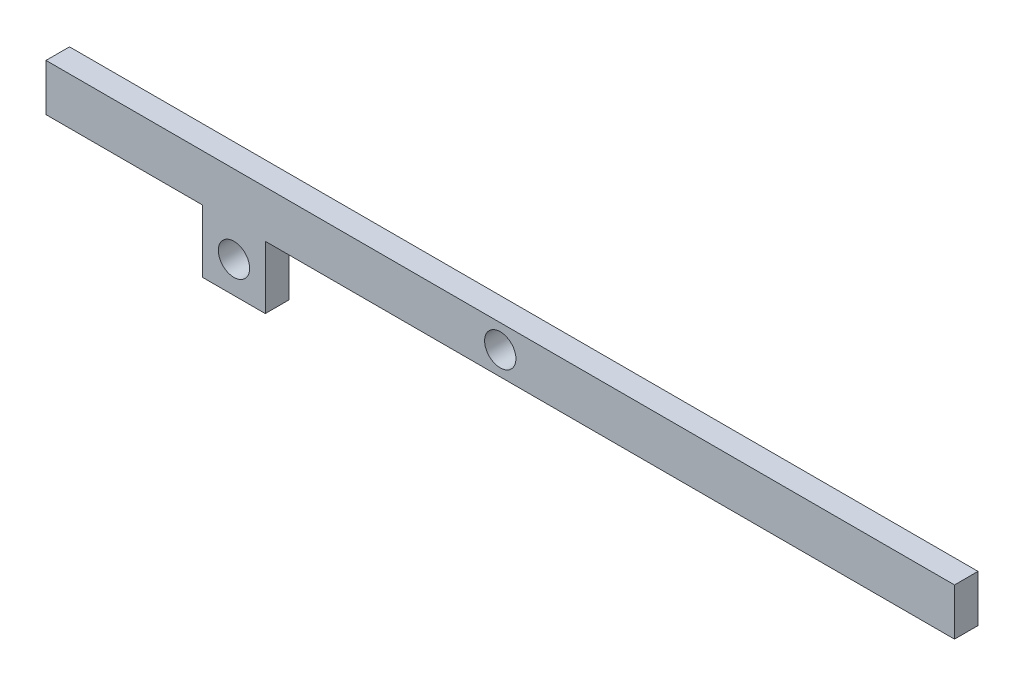
ISO-10303-21;
HEADER;
FILE_DESCRIPTION(('STEP AP214'),'2;1');
FILE_NAME('part.step','',(''),(''),'','','');
FILE_SCHEMA(('AUTOMOTIVE_DESIGN { 1 0 10303 214 1 1 1 1 }'));
ENDSEC;
DATA;
#1=APPLICATION_CONTEXT('core data for automotive mechanical design processes');
#2=APPLICATION_PROTOCOL_DEFINITION('international standard','automotive_design',2000,#1);
#3=PRODUCT_CONTEXT('',#1,'mechanical');
#4=PRODUCT('Part','Part','',(#3));
#5=PRODUCT_RELATED_PRODUCT_CATEGORY('part','',(#4));
#6=PRODUCT_DEFINITION_FORMATION('','',#4);
#7=PRODUCT_DEFINITION_CONTEXT('part definition',#1,'design');
#8=PRODUCT_DEFINITION('design','',#6,#7);
#9=PRODUCT_DEFINITION_SHAPE('','',#8);
#10=(LENGTH_UNIT() NAMED_UNIT(*) SI_UNIT(.MILLI.,.METRE.));
#11=(NAMED_UNIT(*) PLANE_ANGLE_UNIT() SI_UNIT($,.RADIAN.));
#12=(NAMED_UNIT(*) SI_UNIT($,.STERADIAN.) SOLID_ANGLE_UNIT());
#13=UNCERTAINTY_MEASURE_WITH_UNIT(LENGTH_MEASURE(1.E-05),#10,'distance_accuracy_value','');
#14=(GEOMETRIC_REPRESENTATION_CONTEXT(3) GLOBAL_UNCERTAINTY_ASSIGNED_CONTEXT((#13)) GLOBAL_UNIT_ASSIGNED_CONTEXT((#10,
#11,#12)) REPRESENTATION_CONTEXT('',''));
#15=CARTESIAN_POINT('',(0.,0.,0.));
#16=DIRECTION('',(0.,0.,1.));
#17=DIRECTION('',(1.,0.,0.));
#18=AXIS2_PLACEMENT_3D('',#15,#16,#17);
#19=CARTESIAN_POINT('',(290.,-15.,7.5));
#20=DIRECTION('',(0.,1.,0.));
#21=DIRECTION('',(-1.,0.,0.));
#22=AXIS2_PLACEMENT_3D('',#19,#20,#21);
#23=PLANE('',#22);
#24=DIRECTION('',(0.,0.,1.));
#25=VECTOR('',#24,1.);
#26=CARTESIAN_POINT('',(-150.,-15.,-7.5));
#27=LINE('',#26,#25);
#28=CARTESIAN_POINT('',(-150.,-15.,-7.5));
#29=VERTEX_POINT('',#28);
#30=CARTESIAN_POINT('',(-150.,-15.,7.5));
#31=VERTEX_POINT('',#30);
#32=EDGE_CURVE('E152',#29,#31,#27,.T.);
#33=ORIENTED_EDGE('',*,*,#32,.F.);
#34=DIRECTION('',(1.,0.,0.));
#35=VECTOR('',#34,1.);
#36=CARTESIAN_POINT('',(290.,-15.,-7.5));
#37=LINE('',#36,#35);
#38=CARTESIAN_POINT('',(290.,-15.,-7.5));
#39=VERTEX_POINT('',#38);
#40=EDGE_CURVE('E168',#29,#39,#37,.T.);
#41=ORIENTED_EDGE('',*,*,#40,.T.);
#42=DIRECTION('',(0.,0.,-1.));
#43=VECTOR('',#42,1.);
#44=CARTESIAN_POINT('',(290.,-15.,7.5));
#45=LINE('',#44,#43);
#46=CARTESIAN_POINT('',(290.,-15.,7.5));
#47=VERTEX_POINT('',#46);
#48=EDGE_CURVE('E50',#47,#39,#45,.T.);
#49=ORIENTED_EDGE('',*,*,#48,.F.);
#50=DIRECTION('',(1.,0.,0.));
#51=VECTOR('',#50,1.);
#52=CARTESIAN_POINT('',(290.,-15.,7.5));
#53=LINE('',#52,#51);
#54=EDGE_CURVE('E159',#31,#47,#53,.T.);
#55=ORIENTED_EDGE('',*,*,#54,.F.);
#56=EDGE_LOOP('',(#33,#41,#49,#55));
#57=FACE_BOUND('',#56,.T.);
#58=ADVANCED_FACE('F41',(#57),#23,.F.);
#59=CARTESIAN_POINT('',(-290.,15.,7.5));
#60=DIRECTION('',(1.,0.,0.));
#61=DIRECTION('',(0.,0.,-1.));
#62=AXIS2_PLACEMENT_3D('',#59,#60,#61);
#63=PLANE('',#62);
#64=DIRECTION('',(0.,-1.,0.));
#65=VECTOR('',#64,1.);
#66=CARTESIAN_POINT('',(-290.,15.,-7.5));
#67=LINE('',#66,#65);
#68=CARTESIAN_POINT('',(-290.,15.,-7.5));
#69=VERTEX_POINT('',#68);
#70=CARTESIAN_POINT('',(-290.,-15.,-7.5));
#71=VERTEX_POINT('',#70);
#72=EDGE_CURVE('E165',#69,#71,#67,.T.);
#73=ORIENTED_EDGE('',*,*,#72,.T.);
#74=DIRECTION('',(0.,0.,-1.));
#75=VECTOR('',#74,1.);
#76=CARTESIAN_POINT('',(-290.,-15.,7.5));
#77=LINE('',#76,#75);
#78=CARTESIAN_POINT('',(-290.,-15.,7.5));
#79=VERTEX_POINT('',#78);
#80=EDGE_CURVE('E11',#79,#71,#77,.T.);
#81=ORIENTED_EDGE('',*,*,#80,.F.);
#82=DIRECTION('',(0.,-1.,0.));
#83=VECTOR('',#82,1.);
#84=CARTESIAN_POINT('',(-290.,15.,7.5));
#85=LINE('',#84,#83);
#86=CARTESIAN_POINT('',(-290.,15.,7.5));
#87=VERTEX_POINT('',#86);
#88=EDGE_CURVE('E157',#87,#79,#85,.T.);
#89=ORIENTED_EDGE('',*,*,#88,.F.);
#90=DIRECTION('',(0.,0.,-1.));
#91=VECTOR('',#90,1.);
#92=CARTESIAN_POINT('',(-290.,15.,7.5));
#93=LINE('',#92,#91);
#94=EDGE_CURVE('E164',#87,#69,#93,.T.);
#95=ORIENTED_EDGE('',*,*,#94,.T.);
#96=EDGE_LOOP('',(#73,#81,#89,#95));
#97=FACE_BOUND('',#96,.T.);
#98=ADVANCED_FACE('F43',(#97),#63,.F.);
#99=CARTESIAN_POINT('',(-190.,-15.,-7.5));
#100=VERTEX_POINT('',#99);
#101=EDGE_CURVE('E169',#71,#100,#37,.T.);
#102=ORIENTED_EDGE('',*,*,#101,.T.);
#103=DIRECTION('',(0.,0.,1.));
#104=VECTOR('',#103,1.);
#105=CARTESIAN_POINT('',(-190.,-15.,-7.5));
#106=LINE('',#105,#104);
#107=CARTESIAN_POINT('',(-190.,-15.,7.5));
#108=VERTEX_POINT('',#107);
#109=EDGE_CURVE('E137',#100,#108,#106,.T.);
#110=ORIENTED_EDGE('',*,*,#109,.T.);
#111=EDGE_CURVE('E93',#79,#108,#53,.T.);
#112=ORIENTED_EDGE('',*,*,#111,.F.);
#113=ORIENTED_EDGE('',*,*,#80,.T.);
#114=EDGE_LOOP('',(#102,#110,#112,#113));
#115=FACE_BOUND('',#114,.T.);
#116=ADVANCED_FACE('F199',(#115),#23,.F.);
#117=CARTESIAN_POINT('',(290.,15.,7.5));
#118=DIRECTION('',(-1.,0.,0.));
#119=DIRECTION('',(0.,0.,1.));
#120=AXIS2_PLACEMENT_3D('',#117,#118,#119);
#121=PLANE('',#120);
#122=DIRECTION('',(0.,1.,0.));
#123=VECTOR('',#122,1.);
#124=CARTESIAN_POINT('',(290.,15.,-7.5));
#125=LINE('',#124,#123);
#126=CARTESIAN_POINT('',(290.,15.,-7.5));
#127=VERTEX_POINT('',#126);
#128=EDGE_CURVE('E171',#39,#127,#125,.T.);
#129=ORIENTED_EDGE('',*,*,#128,.T.);
#130=DIRECTION('',(0.,0.,-1.));
#131=VECTOR('',#130,1.);
#132=CARTESIAN_POINT('',(290.,15.,7.5));
#133=LINE('',#132,#131);
#134=CARTESIAN_POINT('',(290.,15.,7.5));
#135=VERTEX_POINT('',#134);
#136=EDGE_CURVE('E175',#135,#127,#133,.T.);
#137=ORIENTED_EDGE('',*,*,#136,.F.);
#138=DIRECTION('',(0.,1.,0.));
#139=VECTOR('',#138,1.);
#140=CARTESIAN_POINT('',(290.,15.,7.5));
#141=LINE('',#140,#139);
#142=EDGE_CURVE('E161',#47,#135,#141,.T.);
#143=ORIENTED_EDGE('',*,*,#142,.F.);
#144=ORIENTED_EDGE('',*,*,#48,.T.);
#145=EDGE_LOOP('',(#129,#137,#143,#144));
#146=FACE_BOUND('',#145,.T.);
#147=ADVANCED_FACE('F182',(#146),#121,.F.);
#148=CARTESIAN_POINT('',(290.,15.,7.5));
#149=DIRECTION('',(0.,-1.,0.));
#150=DIRECTION('',(1.,0.,0.));
#151=AXIS2_PLACEMENT_3D('',#148,#149,#150);
#152=PLANE('',#151);
#153=DIRECTION('',(-1.,0.,0.));
#154=VECTOR('',#153,1.);
#155=CARTESIAN_POINT('',(290.,15.,-7.5));
#156=LINE('',#155,#154);
#157=EDGE_CURVE('E87',#127,#69,#156,.T.);
#158=ORIENTED_EDGE('',*,*,#157,.T.);
#159=ORIENTED_EDGE('',*,*,#94,.F.);
#160=DIRECTION('',(-1.,0.,0.));
#161=VECTOR('',#160,1.);
#162=CARTESIAN_POINT('',(290.,15.,7.5));
#163=LINE('',#162,#161);
#164=EDGE_CURVE('E66',#135,#87,#163,.T.);
#165=ORIENTED_EDGE('',*,*,#164,.F.);
#166=ORIENTED_EDGE('',*,*,#136,.T.);
#167=EDGE_LOOP('',(#158,#159,#165,#166));
#168=FACE_BOUND('',#167,.T.);
#169=ADVANCED_FACE('F189',(#168),#152,.F.);
#170=CARTESIAN_POINT('',(0.,0.,7.5));
#171=DIRECTION('',(0.,0.,-1.));
#172=DIRECTION('',(-1.,0.,0.));
#173=AXIS2_PLACEMENT_3D('',#170,#171,#172);
#174=PLANE('',#173);
#175=CARTESIAN_POINT('',(0.,0.,7.5));
#176=DIRECTION('',(0.,0.,1.));
#177=DIRECTION('',(1.,0.,0.));
#178=AXIS2_PLACEMENT_3D('',#175,#176,#177);
#179=CIRCLE('',#178,10.);
#180=CARTESIAN_POINT('',(10.,0.,7.5));
#181=VERTEX_POINT('',#180);
#182=EDGE_CURVE('E151',#181,#181,#179,.T.);
#183=ORIENTED_EDGE('',*,*,#182,.F.);
#184=EDGE_LOOP('',(#183));
#185=FACE_BOUND('',#184,.T.);
#186=ORIENTED_EDGE('',*,*,#88,.T.);
#187=ORIENTED_EDGE('',*,*,#111,.T.);
#188=DIRECTION('',(0.,-1.,0.));
#189=VECTOR('',#188,1.);
#190=CARTESIAN_POINT('',(-190.,-15.,7.5));
#191=LINE('',#190,#189);
#192=CARTESIAN_POINT('',(-190.,-55.,7.5));
#193=VERTEX_POINT('',#192);
#194=EDGE_CURVE('E57',#108,#193,#191,.T.);
#195=ORIENTED_EDGE('',*,*,#194,.T.);
#196=DIRECTION('',(1.,0.,0.));
#197=VECTOR('',#196,1.);
#198=CARTESIAN_POINT('',(-190.,-55.,7.5));
#199=LINE('',#198,#197);
#200=CARTESIAN_POINT('',(-150.,-55.,7.5));
#201=VERTEX_POINT('',#200);
#202=EDGE_CURVE('E121',#193,#201,#199,.T.);
#203=ORIENTED_EDGE('',*,*,#202,.T.);
#204=DIRECTION('',(0.,1.,0.));
#205=VECTOR('',#204,1.);
#206=CARTESIAN_POINT('',(-150.,-15.,7.5));
#207=LINE('',#206,#205);
#208=EDGE_CURVE('E138',#201,#31,#207,.T.);
#209=ORIENTED_EDGE('',*,*,#208,.T.);
#210=ORIENTED_EDGE('',*,*,#54,.T.);
#211=ORIENTED_EDGE('',*,*,#142,.T.);
#212=ORIENTED_EDGE('',*,*,#164,.T.);
#213=EDGE_LOOP('',(#186,#187,#195,#203,#209,#210,#211,#212));
#214=FACE_BOUND('',#213,.T.);
#215=CARTESIAN_POINT('',(-170.,-35.,7.5));
#216=DIRECTION('',(0.,0.,1.));
#217=DIRECTION('',(1.,0.,0.));
#218=AXIS2_PLACEMENT_3D('',#215,#216,#217);
#219=CIRCLE('',#218,10.);
#220=CARTESIAN_POINT('',(-160.,-35.,7.5));
#221=VERTEX_POINT('',#220);
#222=EDGE_CURVE('E143',#221,#221,#219,.T.);
#223=ORIENTED_EDGE('',*,*,#222,.F.);
#224=EDGE_LOOP('',(#223));
#225=FACE_BOUND('',#224,.T.);
#226=ADVANCED_FACE('F191',(#185,#214,#225),#174,.F.);
#227=CARTESIAN_POINT('',(0.,0.,-7.5));
#228=DIRECTION('',(0.,0.,-1.));
#229=DIRECTION('',(-1.,0.,0.));
#230=AXIS2_PLACEMENT_3D('',#227,#228,#229);
#231=PLANE('',#230);
#232=CARTESIAN_POINT('',(0.,0.,-7.5));
#233=DIRECTION('',(0.,0.,-1.));
#234=DIRECTION('',(-1.,0.,0.));
#235=AXIS2_PLACEMENT_3D('',#232,#233,#234);
#236=CIRCLE('',#235,10.);
#237=CARTESIAN_POINT('',(-10.,0.,-7.5));
#238=VERTEX_POINT('',#237);
#239=EDGE_CURVE('E45',#238,#238,#236,.T.);
#240=ORIENTED_EDGE('',*,*,#239,.F.);
#241=EDGE_LOOP('',(#240));
#242=FACE_BOUND('',#241,.T.);
#243=ORIENTED_EDGE('',*,*,#72,.F.);
#244=ORIENTED_EDGE('',*,*,#157,.F.);
#245=ORIENTED_EDGE('',*,*,#128,.F.);
#246=ORIENTED_EDGE('',*,*,#40,.F.);
#247=DIRECTION('',(0.,1.,0.));
#248=VECTOR('',#247,1.);
#249=CARTESIAN_POINT('',(-150.,-15.,-7.5));
#250=LINE('',#249,#248);
#251=CARTESIAN_POINT('',(-150.,-55.,-7.5));
#252=VERTEX_POINT('',#251);
#253=EDGE_CURVE('E124',#252,#29,#250,.T.);
#254=ORIENTED_EDGE('',*,*,#253,.F.);
#255=DIRECTION('',(1.,0.,0.));
#256=VECTOR('',#255,1.);
#257=CARTESIAN_POINT('',(-190.,-55.,-7.5));
#258=LINE('',#257,#256);
#259=CARTESIAN_POINT('',(-190.,-55.,-7.5));
#260=VERTEX_POINT('',#259);
#261=EDGE_CURVE('E119',#260,#252,#258,.T.);
#262=ORIENTED_EDGE('',*,*,#261,.F.);
#263=DIRECTION('',(0.,-1.,0.));
#264=VECTOR('',#263,1.);
#265=CARTESIAN_POINT('',(-190.,-15.,-7.5));
#266=LINE('',#265,#264);
#267=EDGE_CURVE('E132',#100,#260,#266,.T.);
#268=ORIENTED_EDGE('',*,*,#267,.F.);
#269=ORIENTED_EDGE('',*,*,#101,.F.);
#270=EDGE_LOOP('',(#243,#244,#245,#246,#254,#262,#268,#269));
#271=FACE_BOUND('',#270,.T.);
#272=CARTESIAN_POINT('',(-170.,-35.,-7.5));
#273=DIRECTION('',(0.,0.,1.));
#274=DIRECTION('',(1.,0.,0.));
#275=AXIS2_PLACEMENT_3D('',#272,#273,#274);
#276=CIRCLE('',#275,10.);
#277=CARTESIAN_POINT('',(-160.,-35.,-7.5));
#278=VERTEX_POINT('',#277);
#279=EDGE_CURVE('E148',#278,#278,#276,.T.);
#280=ORIENTED_EDGE('',*,*,#279,.T.);
#281=EDGE_LOOP('',(#280));
#282=FACE_BOUND('',#281,.T.);
#283=ADVANCED_FACE('F130',(#242,#271,#282),#231,.T.);
#284=CARTESIAN_POINT('',(0.,0.,-12.5));
#285=DIRECTION('',(0.,0.,1.));
#286=DIRECTION('',(1.,0.,0.));
#287=AXIS2_PLACEMENT_3D('',#284,#285,#286);
#288=CYLINDRICAL_SURFACE('',#287,10.);
#289=ORIENTED_EDGE('',*,*,#239,.T.);
#290=EDGE_LOOP('',(#289));
#291=FACE_BOUND('',#290,.T.);
#292=ORIENTED_EDGE('',*,*,#182,.T.);
#293=EDGE_LOOP('',(#292));
#294=FACE_BOUND('',#293,.T.);
#295=ADVANCED_FACE('F222',(#291,#294),#288,.F.);
#296=CARTESIAN_POINT('',(-190.,-15.,-7.5));
#297=DIRECTION('',(-1.,0.,0.));
#298=DIRECTION('',(0.,-1.,0.));
#299=AXIS2_PLACEMENT_3D('',#296,#297,#298);
#300=PLANE('',#299);
#301=ORIENTED_EDGE('',*,*,#194,.F.);
#302=ORIENTED_EDGE('',*,*,#109,.F.);
#303=ORIENTED_EDGE('',*,*,#267,.T.);
#304=DIRECTION('',(0.,0.,1.));
#305=VECTOR('',#304,1.);
#306=CARTESIAN_POINT('',(-190.,-55.,-7.5));
#307=LINE('',#306,#305);
#308=EDGE_CURVE('E116',#260,#193,#307,.T.);
#309=ORIENTED_EDGE('',*,*,#308,.T.);
#310=EDGE_LOOP('',(#301,#302,#303,#309));
#311=FACE_BOUND('',#310,.T.);
#312=ADVANCED_FACE('F136',(#311),#300,.T.);
#313=CARTESIAN_POINT('',(-150.,-15.,-7.5));
#314=DIRECTION('',(1.,0.,0.));
#315=DIRECTION('',(0.,0.,-1.));
#316=AXIS2_PLACEMENT_3D('',#313,#314,#315);
#317=PLANE('',#316);
#318=ORIENTED_EDGE('',*,*,#208,.F.);
#319=DIRECTION('',(0.,0.,1.));
#320=VECTOR('',#319,1.);
#321=CARTESIAN_POINT('',(-150.,-55.,-7.5));
#322=LINE('',#321,#320);
#323=EDGE_CURVE('E123',#252,#201,#322,.T.);
#324=ORIENTED_EDGE('',*,*,#323,.F.);
#325=ORIENTED_EDGE('',*,*,#253,.T.);
#326=ORIENTED_EDGE('',*,*,#32,.T.);
#327=EDGE_LOOP('',(#318,#324,#325,#326));
#328=FACE_BOUND('',#327,.T.);
#329=ADVANCED_FACE('F213',(#328),#317,.T.);
#330=CARTESIAN_POINT('',(-190.,-55.,-7.5));
#331=DIRECTION('',(0.,-1.,0.));
#332=DIRECTION('',(0.,0.,-1.));
#333=AXIS2_PLACEMENT_3D('',#330,#331,#332);
#334=PLANE('',#333);
#335=ORIENTED_EDGE('',*,*,#202,.F.);
#336=ORIENTED_EDGE('',*,*,#308,.F.);
#337=ORIENTED_EDGE('',*,*,#261,.T.);
#338=ORIENTED_EDGE('',*,*,#323,.T.);
#339=EDGE_LOOP('',(#335,#336,#337,#338));
#340=FACE_BOUND('',#339,.T.);
#341=ADVANCED_FACE('F118',(#340),#334,.T.);
#342=CARTESIAN_POINT('',(-170.,-35.,-7.5));
#343=DIRECTION('',(0.,0.,1.));
#344=DIRECTION('',(1.,0.,0.));
#345=AXIS2_PLACEMENT_3D('',#342,#343,#344);
#346=CYLINDRICAL_SURFACE('',#345,10.);
#347=ORIENTED_EDGE('',*,*,#279,.F.);
#348=EDGE_LOOP('',(#347));
#349=FACE_BOUND('',#348,.T.);
#350=ORIENTED_EDGE('',*,*,#222,.T.);
#351=EDGE_LOOP('',(#350));
#352=FACE_BOUND('',#351,.T.);
#353=ADVANCED_FACE('F220',(#349,#352),#346,.F.);
#354=CLOSED_SHELL('',(#58,#98,#116,#147,#169,#226,#283,#295,#312,#329,#341,#353));
#355=MANIFOLD_SOLID_BREP('B2',#354);
#356=ADVANCED_BREP_SHAPE_REPRESENTATION('',(#18,#355),#14);
#357=SHAPE_DEFINITION_REPRESENTATION(#9,#356);
ENDSEC;
END-ISO-10303-21;
